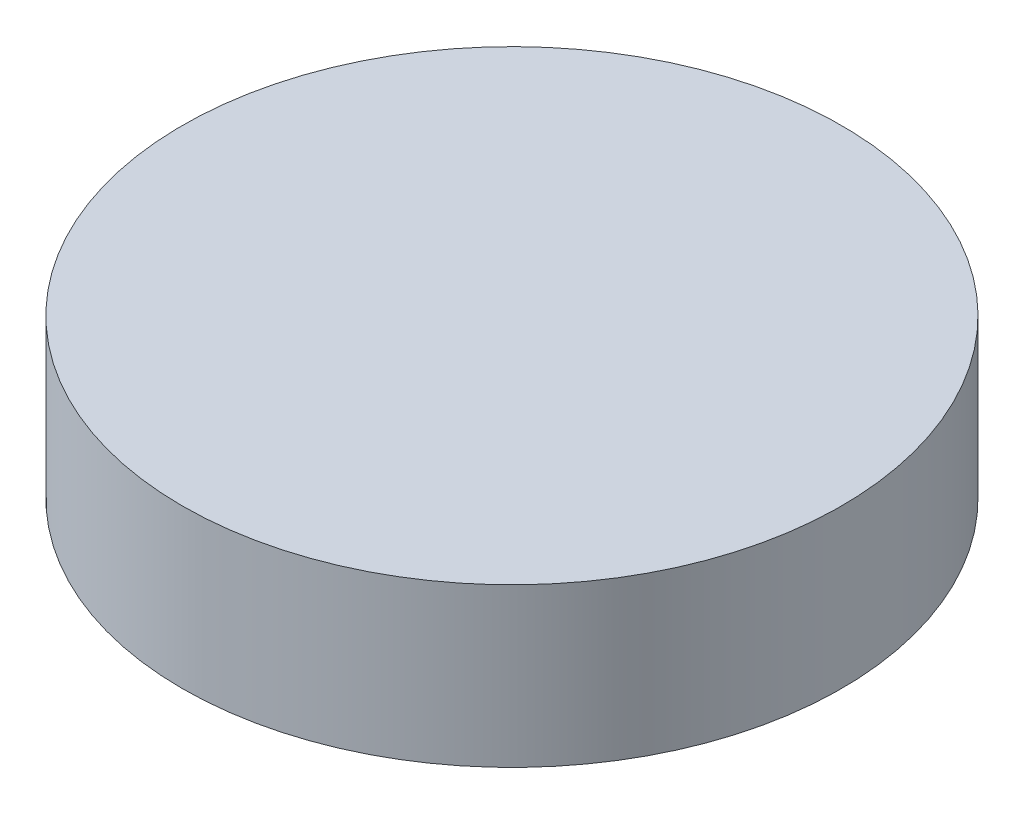
ISO-10303-21;
HEADER;
FILE_DESCRIPTION(('STEP AP214'),'2;1');
FILE_NAME('part.step','',(''),(''),'','','');
FILE_SCHEMA(('AUTOMOTIVE_DESIGN { 1 0 10303 214 1 1 1 1 }'));
ENDSEC;
DATA;
#1=APPLICATION_CONTEXT('core data for automotive mechanical design processes');
#2=APPLICATION_PROTOCOL_DEFINITION('international standard','automotive_design',2000,#1);
#3=PRODUCT_CONTEXT('',#1,'mechanical');
#4=PRODUCT('Part','Part','',(#3));
#5=PRODUCT_RELATED_PRODUCT_CATEGORY('part','',(#4));
#6=PRODUCT_DEFINITION_FORMATION('','',#4);
#7=PRODUCT_DEFINITION_CONTEXT('part definition',#1,'design');
#8=PRODUCT_DEFINITION('design','',#6,#7);
#9=PRODUCT_DEFINITION_SHAPE('','',#8);
#10=(LENGTH_UNIT() NAMED_UNIT(*) SI_UNIT(.MILLI.,.METRE.));
#11=(NAMED_UNIT(*) PLANE_ANGLE_UNIT() SI_UNIT($,.RADIAN.));
#12=(NAMED_UNIT(*) SI_UNIT($,.STERADIAN.) SOLID_ANGLE_UNIT());
#13=UNCERTAINTY_MEASURE_WITH_UNIT(LENGTH_MEASURE(1.E-05),#10,'distance_accuracy_value','');
#14=(GEOMETRIC_REPRESENTATION_CONTEXT(3) GLOBAL_UNCERTAINTY_ASSIGNED_CONTEXT((#13)) GLOBAL_UNIT_ASSIGNED_CONTEXT((#10,
#11,#12)) REPRESENTATION_CONTEXT('',''));
#15=CARTESIAN_POINT('',(0.,0.,0.));
#16=DIRECTION('',(0.,0.,1.));
#17=DIRECTION('',(1.,0.,0.));
#18=AXIS2_PLACEMENT_3D('',#15,#16,#17);
#19=CARTESIAN_POINT('',(0.,3.,0.));
#20=DIRECTION('',(0.,-1.,0.));
#21=DIRECTION('',(0.,0.,-1.));
#22=AXIS2_PLACEMENT_3D('',#19,#20,#21);
#23=CYLINDRICAL_SURFACE('',#22,6.25);
#24=CARTESIAN_POINT('',(0.,3.,0.));
#25=DIRECTION('',(0.,1.,0.));
#26=DIRECTION('',(0.,0.,1.));
#27=AXIS2_PLACEMENT_3D('',#24,#25,#26);
#28=CIRCLE('',#27,6.25);
#29=CARTESIAN_POINT('',(0.,3.,6.25));
#30=VERTEX_POINT('',#29);
#31=EDGE_CURVE('E10',#30,#30,#28,.T.);
#32=ORIENTED_EDGE('',*,*,#31,.F.);
#33=EDGE_LOOP('',(#32));
#34=FACE_BOUND('',#33,.T.);
#35=CARTESIAN_POINT('',(0.,0.,0.));
#36=DIRECTION('',(0.,1.,0.));
#37=DIRECTION('',(0.,0.,1.));
#38=AXIS2_PLACEMENT_3D('',#35,#36,#37);
#39=CIRCLE('',#38,6.25);
#40=CARTESIAN_POINT('',(0.,0.,6.25));
#41=VERTEX_POINT('',#40);
#42=EDGE_CURVE('E36',#41,#41,#39,.T.);
#43=ORIENTED_EDGE('',*,*,#42,.T.);
#44=EDGE_LOOP('',(#43));
#45=FACE_BOUND('',#44,.T.);
#46=ADVANCED_FACE('F33',(#34,#45),#23,.T.);
#47=CARTESIAN_POINT('',(0.,3.,0.));
#48=DIRECTION('',(0.,1.,0.));
#49=DIRECTION('',(0.,0.,1.));
#50=AXIS2_PLACEMENT_3D('',#47,#48,#49);
#51=PLANE('',#50);
#52=ORIENTED_EDGE('',*,*,#31,.T.);
#53=EDGE_LOOP('',(#52));
#54=FACE_BOUND('',#53,.T.);
#55=ADVANCED_FACE('F48',(#54),#51,.T.);
#56=CARTESIAN_POINT('',(0.,0.,0.));
#57=DIRECTION('',(0.,1.,0.));
#58=DIRECTION('',(0.,0.,1.));
#59=AXIS2_PLACEMENT_3D('',#56,#57,#58);
#60=PLANE('',#59);
#61=ORIENTED_EDGE('',*,*,#42,.F.);
#62=EDGE_LOOP('',(#61));
#63=FACE_BOUND('',#62,.T.);
#64=ADVANCED_FACE('F46',(#63),#60,.F.);
#65=CLOSED_SHELL('',(#46,#55,#64));
#66=MANIFOLD_SOLID_BREP('B2',#65);
#67=ADVANCED_BREP_SHAPE_REPRESENTATION('',(#18,#66),#14);
#68=SHAPE_DEFINITION_REPRESENTATION(#9,#67);
ENDSEC;
END-ISO-10303-21;
